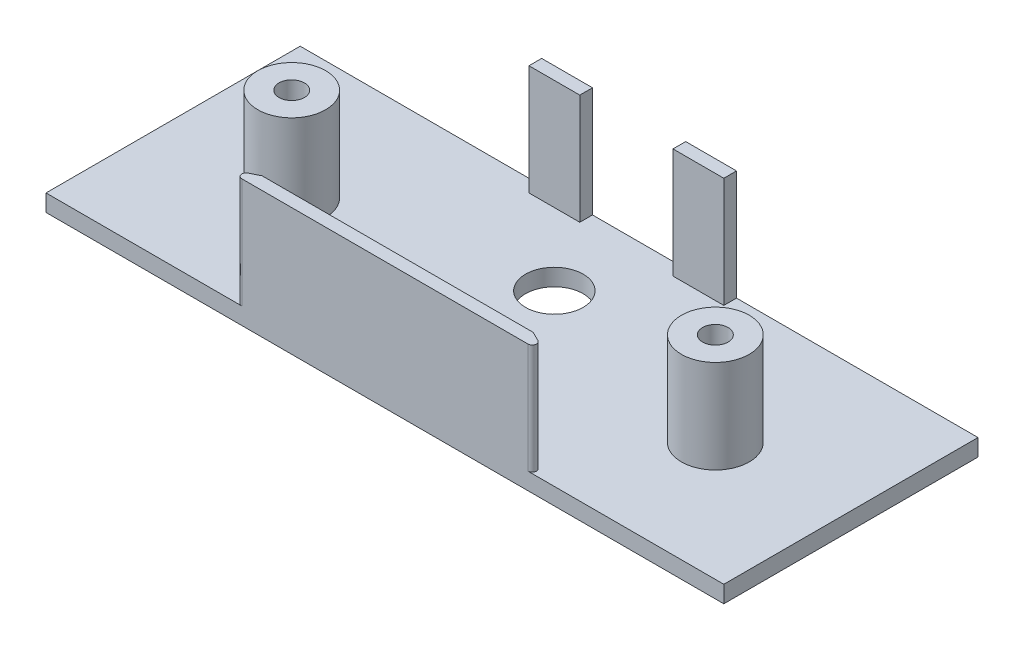
ISO-10303-21;
HEADER;
FILE_DESCRIPTION(('STEP AP214'),'2;1');
FILE_NAME('part.step','',(''),(''),'','','');
FILE_SCHEMA(('AUTOMOTIVE_DESIGN { 1 0 10303 214 1 1 1 1 }'));
ENDSEC;
DATA;
#1=APPLICATION_CONTEXT('core data for automotive mechanical design processes');
#2=APPLICATION_PROTOCOL_DEFINITION('international standard','automotive_design',2000,#1);
#3=PRODUCT_CONTEXT('',#1,'mechanical');
#4=PRODUCT('Part','Part','',(#3));
#5=PRODUCT_RELATED_PRODUCT_CATEGORY('part','',(#4));
#6=PRODUCT_DEFINITION_FORMATION('','',#4);
#7=PRODUCT_DEFINITION_CONTEXT('part definition',#1,'design');
#8=PRODUCT_DEFINITION('design','',#6,#7);
#9=PRODUCT_DEFINITION_SHAPE('','',#8);
#10=(LENGTH_UNIT() NAMED_UNIT(*) SI_UNIT(.MILLI.,.METRE.));
#11=(NAMED_UNIT(*) PLANE_ANGLE_UNIT() SI_UNIT($,.RADIAN.));
#12=(NAMED_UNIT(*) SI_UNIT($,.STERADIAN.) SOLID_ANGLE_UNIT());
#13=UNCERTAINTY_MEASURE_WITH_UNIT(LENGTH_MEASURE(1.E-05),#10,'distance_accuracy_value','');
#14=(GEOMETRIC_REPRESENTATION_CONTEXT(3) GLOBAL_UNCERTAINTY_ASSIGNED_CONTEXT((#13)) GLOBAL_UNIT_ASSIGNED_CONTEXT((#10,
#11,#12)) REPRESENTATION_CONTEXT('',''));
#15=CARTESIAN_POINT('',(0.,0.,0.));
#16=DIRECTION('',(0.,0.,1.));
#17=DIRECTION('',(1.,0.,0.));
#18=AXIS2_PLACEMENT_3D('',#15,#16,#17);
#19=CARTESIAN_POINT('',(0.,2.,0.));
#20=DIRECTION('',(0.,-1.,0.));
#21=DIRECTION('',(0.,0.,-1.));
#22=AXIS2_PLACEMENT_3D('',#19,#20,#21);
#23=PLANE('',#22);
#24=CARTESIAN_POINT('',(50.,2.,0.));
#25=DIRECTION('',(0.,-1.,0.));
#26=DIRECTION('',(0.,0.,-1.));
#27=AXIS2_PLACEMENT_3D('',#24,#25,#26);
#28=CIRCLE('',#27,4.00000000000001);
#29=CARTESIAN_POINT('',(50.,2.,-4.00000000000001));
#30=VERTEX_POINT('',#29);
#31=EDGE_CURVE('E287',#30,#30,#28,.F.);
#32=ORIENTED_EDGE('',*,*,#31,.F.);
#33=EDGE_LOOP('',(#32));
#34=FACE_BOUND('',#33,.T.);
#35=CARTESIAN_POINT('',(25.,2.,-6.));
#36=DIRECTION('',(0.,1.,0.));
#37=DIRECTION('',(0.,0.,1.));
#38=AXIS2_PLACEMENT_3D('',#35,#36,#37);
#39=CIRCLE('',#38,3.4);
#40=CARTESIAN_POINT('',(25.,2.,-2.6));
#41=VERTEX_POINT('',#40);
#42=EDGE_CURVE('E243',#41,#41,#39,.T.);
#43=ORIENTED_EDGE('',*,*,#42,.F.);
#44=EDGE_LOOP('',(#43));
#45=FACE_BOUND('',#44,.T.);
#46=DIRECTION('',(-0.894427190999916,0.,0.447213595499958));
#47=VECTOR('',#46,1.);
#48=CARTESIAN_POINT('',(6.,2.,14.));
#49=LINE('',#48,#47);
#50=CARTESIAN_POINT('',(12.9999999999999,2.,10.5));
#51=VERTEX_POINT('',#50);
#52=CARTESIAN_POINT('',(7.89442719099992,2.,13.0527864045));
#53=VERTEX_POINT('',#52);
#54=EDGE_CURVE('E47',#51,#53,#49,.T.);
#55=ORIENTED_EDGE('',*,*,#54,.F.);
#56=DIRECTION('',(1.,0.,0.));
#57=VECTOR('',#56,1.);
#58=CARTESIAN_POINT('',(41.,2.,10.5));
#59=LINE('',#58,#57);
#60=CARTESIAN_POINT('',(37.0000000000001,2.,10.5));
#61=VERTEX_POINT('',#60);
#62=EDGE_CURVE('E314',#51,#61,#59,.T.);
#63=ORIENTED_EDGE('',*,*,#62,.T.);
#64=DIRECTION('',(-0.894427190999916,0.,-0.447213595499958));
#65=VECTOR('',#64,1.);
#66=CARTESIAN_POINT('',(44.,2.,14.));
#67=LINE('',#66,#65);
#68=CARTESIAN_POINT('',(42.1055728090001,2.,13.0527864045));
#69=VERTEX_POINT('',#68);
#70=EDGE_CURVE('E54',#69,#61,#67,.T.);
#71=ORIENTED_EDGE('',*,*,#70,.F.);
#72=CARTESIAN_POINT('',(41.8819660112501,2.,13.5));
#73=DIRECTION('',(0.,-1.,0.));
#74=DIRECTION('',(0.,0.,-1.));
#75=AXIS2_PLACEMENT_3D('',#72,#73,#74);
#76=CIRCLE('',#75,0.5);
#77=CARTESIAN_POINT('',(41.8819660112501,2.,14.));
#78=VERTEX_POINT('',#77);
#79=EDGE_CURVE('E308',#69,#78,#76,.T.);
#80=ORIENTED_EDGE('',*,*,#79,.T.);
#81=DIRECTION('',(1.,0.,0.));
#82=VECTOR('',#81,1.);
#83=CARTESIAN_POINT('',(-15.,2.,14.));
#84=LINE('',#83,#82);
#85=CARTESIAN_POINT('',(65.,2.,14.));
#86=VERTEX_POINT('',#85);
#87=EDGE_CURVE('E258',#78,#86,#84,.T.);
#88=ORIENTED_EDGE('',*,*,#87,.T.);
#89=DIRECTION('',(0.,0.,-1.));
#90=VECTOR('',#89,1.);
#91=CARTESIAN_POINT('',(65.,2.,14.));
#92=LINE('',#91,#90);
#93=CARTESIAN_POINT('',(65.,2.,-16.));
#94=VERTEX_POINT('',#93);
#95=EDGE_CURVE('E262',#86,#94,#92,.T.);
#96=ORIENTED_EDGE('',*,*,#95,.T.);
#97=DIRECTION('',(-1.,0.,0.));
#98=VECTOR('',#97,1.);
#99=CARTESIAN_POINT('',(-15.,2.,-16.));
#100=LINE('',#99,#98);
#101=CARTESIAN_POINT('',(36.5,2.,-16.));
#102=VERTEX_POINT('',#101);
#103=EDGE_CURVE('E265',#94,#102,#100,.T.);
#104=ORIENTED_EDGE('',*,*,#103,.T.);
#105=DIRECTION('',(0.,0.,-1.));
#106=VECTOR('',#105,1.);
#107=CARTESIAN_POINT('',(36.5,2.,-16.));
#108=LINE('',#107,#106);
#109=CARTESIAN_POINT('',(36.5,2.,-14.5));
#110=VERTEX_POINT('',#109);
#111=EDGE_CURVE('E184',#110,#102,#108,.T.);
#112=ORIENTED_EDGE('',*,*,#111,.F.);
#113=DIRECTION('',(1.,0.,0.));
#114=VECTOR('',#113,1.);
#115=CARTESIAN_POINT('',(30.5,2.,-14.5));
#116=LINE('',#115,#114);
#117=CARTESIAN_POINT('',(30.5,2.,-14.5));
#118=VERTEX_POINT('',#117);
#119=EDGE_CURVE('E365',#118,#110,#116,.T.);
#120=ORIENTED_EDGE('',*,*,#119,.F.);
#121=DIRECTION('',(0.,0.,1.));
#122=VECTOR('',#121,1.);
#123=CARTESIAN_POINT('',(30.5,2.,-16.));
#124=LINE('',#123,#122);
#125=CARTESIAN_POINT('',(30.5,2.,-16.));
#126=VERTEX_POINT('',#125);
#127=EDGE_CURVE('E188',#126,#118,#124,.T.);
#128=ORIENTED_EDGE('',*,*,#127,.F.);
#129=CARTESIAN_POINT('',(19.5,2.,-16.));
#130=VERTEX_POINT('',#129);
#131=EDGE_CURVE('E268',#126,#130,#100,.T.);
#132=ORIENTED_EDGE('',*,*,#131,.T.);
#133=DIRECTION('',(0.,0.,-1.));
#134=VECTOR('',#133,1.);
#135=CARTESIAN_POINT('',(19.5,2.,-16.));
#136=LINE('',#135,#134);
#137=CARTESIAN_POINT('',(19.5,2.,-14.5));
#138=VERTEX_POINT('',#137);
#139=EDGE_CURVE('E202',#138,#130,#136,.T.);
#140=ORIENTED_EDGE('',*,*,#139,.F.);
#141=DIRECTION('',(1.,0.,0.));
#142=VECTOR('',#141,1.);
#143=CARTESIAN_POINT('',(13.5,2.,-14.5));
#144=LINE('',#143,#142);
#145=CARTESIAN_POINT('',(13.5,2.,-14.5));
#146=VERTEX_POINT('',#145);
#147=EDGE_CURVE('E192',#146,#138,#144,.T.);
#148=ORIENTED_EDGE('',*,*,#147,.F.);
#149=DIRECTION('',(0.,0.,1.));
#150=VECTOR('',#149,1.);
#151=CARTESIAN_POINT('',(13.5,2.,-16.));
#152=LINE('',#151,#150);
#153=CARTESIAN_POINT('',(13.5,2.,-16.));
#154=VERTEX_POINT('',#153);
#155=EDGE_CURVE('E189',#154,#146,#152,.T.);
#156=ORIENTED_EDGE('',*,*,#155,.F.);
#157=CARTESIAN_POINT('',(-15.,2.,-16.));
#158=VERTEX_POINT('',#157);
#159=EDGE_CURVE('E264',#154,#158,#100,.T.);
#160=ORIENTED_EDGE('',*,*,#159,.T.);
#161=DIRECTION('',(0.,0.,1.));
#162=VECTOR('',#161,1.);
#163=CARTESIAN_POINT('',(-15.,2.,14.));
#164=LINE('',#163,#162);
#165=CARTESIAN_POINT('',(-15.,2.,14.));
#166=VERTEX_POINT('',#165);
#167=EDGE_CURVE('E255',#158,#166,#164,.T.);
#168=ORIENTED_EDGE('',*,*,#167,.T.);
#169=CARTESIAN_POINT('',(8.11803398874989,2.,14.));
#170=VERTEX_POINT('',#169);
#171=EDGE_CURVE('E260',#166,#170,#84,.T.);
#172=ORIENTED_EDGE('',*,*,#171,.T.);
#173=CARTESIAN_POINT('',(8.11803398874989,2.,13.5));
#174=DIRECTION('',(0.,-1.,0.));
#175=DIRECTION('',(0.,0.,-1.));
#176=AXIS2_PLACEMENT_3D('',#173,#174,#175);
#177=CIRCLE('',#176,0.5);
#178=EDGE_CURVE('E306',#170,#53,#177,.T.);
#179=ORIENTED_EDGE('',*,*,#178,.T.);
#180=EDGE_LOOP('',(#55,#63,#71,#80,#88,#96,#104,#112,#120,#128,#132,#140,#148,#156,#160,#168,
#172,#179));
#181=FACE_BOUND('',#180,.T.);
#182=CARTESIAN_POINT('',(0.,2.,0.));
#183=DIRECTION('',(0.,-1.,0.));
#184=DIRECTION('',(0.,0.,-1.));
#185=AXIS2_PLACEMENT_3D('',#182,#183,#184);
#186=CIRCLE('',#185,4.);
#187=CARTESIAN_POINT('',(0.,2.,-4.));
#188=VERTEX_POINT('',#187);
#189=EDGE_CURVE('E290',#188,#188,#186,.F.);
#190=ORIENTED_EDGE('',*,*,#189,.F.);
#191=EDGE_LOOP('',(#190));
#192=FACE_BOUND('',#191,.T.);
#193=ADVANCED_FACE('F32',(#34,#45,#181,#192),#23,.F.);
#194=CARTESIAN_POINT('',(0.,0.,0.));
#195=DIRECTION('',(0.,-1.,0.));
#196=DIRECTION('',(0.,0.,-1.));
#197=AXIS2_PLACEMENT_3D('',#194,#195,#196);
#198=PLANE('',#197);
#199=CARTESIAN_POINT('',(50.,0.,0.));
#200=DIRECTION('',(0.,1.,0.));
#201=DIRECTION('',(0.,0.,1.));
#202=AXIS2_PLACEMENT_3D('',#199,#200,#201);
#203=CIRCLE('',#202,1.5);
#204=CARTESIAN_POINT('',(50.,0.,1.5));
#205=VERTEX_POINT('',#204);
#206=EDGE_CURVE('E246',#205,#205,#203,.T.);
#207=ORIENTED_EDGE('',*,*,#206,.T.);
#208=EDGE_LOOP('',(#207));
#209=FACE_BOUND('',#208,.T.);
#210=DIRECTION('',(0.,0.,1.));
#211=VECTOR('',#210,1.);
#212=CARTESIAN_POINT('',(-15.,0.,14.));
#213=LINE('',#212,#211);
#214=CARTESIAN_POINT('',(-15.,0.,-16.));
#215=VERTEX_POINT('',#214);
#216=CARTESIAN_POINT('',(-15.,0.,14.));
#217=VERTEX_POINT('',#216);
#218=EDGE_CURVE('E254',#215,#217,#213,.T.);
#219=ORIENTED_EDGE('',*,*,#218,.F.);
#220=DIRECTION('',(-1.,0.,0.));
#221=VECTOR('',#220,1.);
#222=CARTESIAN_POINT('',(-15.,0.,-16.));
#223=LINE('',#222,#221);
#224=CARTESIAN_POINT('',(65.,0.,-16.));
#225=VERTEX_POINT('',#224);
#226=EDGE_CURVE('E259',#225,#215,#223,.T.);
#227=ORIENTED_EDGE('',*,*,#226,.F.);
#228=DIRECTION('',(0.,0.,-1.));
#229=VECTOR('',#228,1.);
#230=CARTESIAN_POINT('',(65.,0.,14.));
#231=LINE('',#230,#229);
#232=CARTESIAN_POINT('',(65.,0.,14.));
#233=VERTEX_POINT('',#232);
#234=EDGE_CURVE('E273',#233,#225,#231,.T.);
#235=ORIENTED_EDGE('',*,*,#234,.F.);
#236=DIRECTION('',(1.,0.,0.));
#237=VECTOR('',#236,1.);
#238=CARTESIAN_POINT('',(-15.,0.,14.));
#239=LINE('',#238,#237);
#240=EDGE_CURVE('E271',#217,#233,#239,.T.);
#241=ORIENTED_EDGE('',*,*,#240,.F.);
#242=EDGE_LOOP('',(#219,#227,#235,#241));
#243=FACE_BOUND('',#242,.T.);
#244=CARTESIAN_POINT('',(0.,0.,0.));
#245=DIRECTION('',(0.,1.,0.));
#246=DIRECTION('',(0.,0.,1.));
#247=AXIS2_PLACEMENT_3D('',#244,#245,#246);
#248=CIRCLE('',#247,1.5);
#249=CARTESIAN_POINT('',(0.,0.,1.5));
#250=VERTEX_POINT('',#249);
#251=EDGE_CURVE('E251',#250,#250,#248,.T.);
#252=ORIENTED_EDGE('',*,*,#251,.T.);
#253=EDGE_LOOP('',(#252));
#254=FACE_BOUND('',#253,.T.);
#255=CARTESIAN_POINT('',(25.,0.,-6.));
#256=DIRECTION('',(0.,1.,0.));
#257=DIRECTION('',(0.,0.,1.));
#258=AXIS2_PLACEMENT_3D('',#255,#256,#257);
#259=CIRCLE('',#258,3.4);
#260=CARTESIAN_POINT('',(25.,0.,-2.6));
#261=VERTEX_POINT('',#260);
#262=EDGE_CURVE('E242',#261,#261,#259,.T.);
#263=ORIENTED_EDGE('',*,*,#262,.T.);
#264=EDGE_LOOP('',(#263));
#265=FACE_BOUND('',#264,.T.);
#266=ADVANCED_FACE('F351',(#209,#243,#254,#265),#198,.T.);
#267=CARTESIAN_POINT('',(-15.,2.,14.));
#268=DIRECTION('',(1.,0.,0.));
#269=DIRECTION('',(0.,0.,-1.));
#270=AXIS2_PLACEMENT_3D('',#267,#268,#269);
#271=PLANE('',#270);
#272=ORIENTED_EDGE('',*,*,#218,.T.);
#273=DIRECTION('',(0.,-1.,0.));
#274=VECTOR('',#273,1.);
#275=CARTESIAN_POINT('',(-15.,2.,14.));
#276=LINE('',#275,#274);
#277=EDGE_CURVE('E284',#166,#217,#276,.T.);
#278=ORIENTED_EDGE('',*,*,#277,.F.);
#279=ORIENTED_EDGE('',*,*,#167,.F.);
#280=DIRECTION('',(0.,-1.,0.));
#281=VECTOR('',#280,1.);
#282=CARTESIAN_POINT('',(-15.,2.,-16.));
#283=LINE('',#282,#281);
#284=EDGE_CURVE('E267',#158,#215,#283,.T.);
#285=ORIENTED_EDGE('',*,*,#284,.T.);
#286=EDGE_LOOP('',(#272,#278,#279,#285));
#287=FACE_BOUND('',#286,.T.);
#288=ADVANCED_FACE('F347',(#287),#271,.F.);
#289=CARTESIAN_POINT('',(-15.,2.,14.));
#290=DIRECTION('',(0.,0.,-1.));
#291=DIRECTION('',(-1.,0.,0.));
#292=AXIS2_PLACEMENT_3D('',#289,#290,#291);
#293=PLANE('',#292);
#294=DIRECTION('',(1.,0.,0.));
#295=VECTOR('',#294,1.);
#296=CARTESIAN_POINT('',(6.,15.,14.));
#297=LINE('',#296,#295);
#298=CARTESIAN_POINT('',(8.11803398874989,15.,14.));
#299=VERTEX_POINT('',#298);
#300=CARTESIAN_POINT('',(41.8819660112501,15.,14.));
#301=VERTEX_POINT('',#300);
#302=EDGE_CURVE('E227',#299,#301,#297,.T.);
#303=ORIENTED_EDGE('',*,*,#302,.F.);
#304=DIRECTION('',(0.,-1.,0.));
#305=VECTOR('',#304,1.);
#306=CARTESIAN_POINT('',(8.11803398874989,2.,14.));
#307=LINE('',#306,#305);
#308=EDGE_CURVE('E295',#299,#170,#307,.T.);
#309=ORIENTED_EDGE('',*,*,#308,.T.);
#310=ORIENTED_EDGE('',*,*,#171,.F.);
#311=ORIENTED_EDGE('',*,*,#277,.T.);
#312=ORIENTED_EDGE('',*,*,#240,.T.);
#313=DIRECTION('',(0.,-1.,0.));
#314=VECTOR('',#313,1.);
#315=CARTESIAN_POINT('',(65.,2.,14.));
#316=LINE('',#315,#314);
#317=EDGE_CURVE('E281',#86,#233,#316,.T.);
#318=ORIENTED_EDGE('',*,*,#317,.F.);
#319=ORIENTED_EDGE('',*,*,#87,.F.);
#320=DIRECTION('',(0.,-1.,0.));
#321=VECTOR('',#320,1.);
#322=CARTESIAN_POINT('',(41.8819660112501,2.,14.));
#323=LINE('',#322,#321);
#324=EDGE_CURVE('E293',#78,#301,#323,.F.);
#325=ORIENTED_EDGE('',*,*,#324,.T.);
#326=EDGE_LOOP('',(#303,#309,#310,#311,#312,#318,#319,#325));
#327=FACE_BOUND('',#326,.T.);
#328=ADVANCED_FACE('F333',(#327),#293,.F.);
#329=CARTESIAN_POINT('',(65.,2.,14.));
#330=DIRECTION('',(-1.,0.,0.));
#331=DIRECTION('',(0.,0.,1.));
#332=AXIS2_PLACEMENT_3D('',#329,#330,#331);
#333=PLANE('',#332);
#334=ORIENTED_EDGE('',*,*,#234,.T.);
#335=DIRECTION('',(0.,-1.,0.));
#336=VECTOR('',#335,1.);
#337=CARTESIAN_POINT('',(65.,2.,-16.));
#338=LINE('',#337,#336);
#339=EDGE_CURVE('E278',#94,#225,#338,.T.);
#340=ORIENTED_EDGE('',*,*,#339,.F.);
#341=ORIENTED_EDGE('',*,*,#95,.F.);
#342=ORIENTED_EDGE('',*,*,#317,.T.);
#343=EDGE_LOOP('',(#334,#340,#341,#342));
#344=FACE_BOUND('',#343,.T.);
#345=ADVANCED_FACE('F356',(#344),#333,.F.);
#346=CARTESIAN_POINT('',(-15.,2.,-16.));
#347=DIRECTION('',(0.,0.,1.));
#348=DIRECTION('',(1.,0.,0.));
#349=AXIS2_PLACEMENT_3D('',#346,#347,#348);
#350=PLANE('',#349);
#351=ORIENTED_EDGE('',*,*,#226,.T.);
#352=ORIENTED_EDGE('',*,*,#284,.F.);
#353=ORIENTED_EDGE('',*,*,#159,.F.);
#354=DIRECTION('',(0.,-1.,0.));
#355=VECTOR('',#354,1.);
#356=CARTESIAN_POINT('',(13.5,15.,-16.));
#357=LINE('',#356,#355);
#358=CARTESIAN_POINT('',(13.5,15.,-16.));
#359=VERTEX_POINT('',#358);
#360=EDGE_CURVE('E207',#359,#154,#357,.T.);
#361=ORIENTED_EDGE('',*,*,#360,.F.);
#362=DIRECTION('',(-1.,0.,0.));
#363=VECTOR('',#362,1.);
#364=CARTESIAN_POINT('',(13.5,15.,-16.));
#365=LINE('',#364,#363);
#366=CARTESIAN_POINT('',(19.5,15.,-16.));
#367=VERTEX_POINT('',#366);
#368=EDGE_CURVE('E206',#367,#359,#365,.T.);
#369=ORIENTED_EDGE('',*,*,#368,.F.);
#370=DIRECTION('',(0.,-1.,0.));
#371=VECTOR('',#370,1.);
#372=CARTESIAN_POINT('',(19.5,15.,-16.));
#373=LINE('',#372,#371);
#374=EDGE_CURVE('E215',#367,#130,#373,.T.);
#375=ORIENTED_EDGE('',*,*,#374,.T.);
#376=ORIENTED_EDGE('',*,*,#131,.F.);
#377=DIRECTION('',(0.,-1.,0.));
#378=VECTOR('',#377,1.);
#379=CARTESIAN_POINT('',(30.5,15.,-16.));
#380=LINE('',#379,#378);
#381=CARTESIAN_POINT('',(30.5,15.,-16.));
#382=VERTEX_POINT('',#381);
#383=EDGE_CURVE('E368',#382,#126,#380,.T.);
#384=ORIENTED_EDGE('',*,*,#383,.F.);
#385=DIRECTION('',(-1.,0.,0.));
#386=VECTOR('',#385,1.);
#387=CARTESIAN_POINT('',(30.5,15.,-16.));
#388=LINE('',#387,#386);
#389=CARTESIAN_POINT('',(36.5,15.,-16.));
#390=VERTEX_POINT('',#389);
#391=EDGE_CURVE('E180',#390,#382,#388,.T.);
#392=ORIENTED_EDGE('',*,*,#391,.F.);
#393=DIRECTION('',(0.,-1.,0.));
#394=VECTOR('',#393,1.);
#395=CARTESIAN_POINT('',(36.5,15.,-16.));
#396=LINE('',#395,#394);
#397=EDGE_CURVE('E194',#390,#102,#396,.T.);
#398=ORIENTED_EDGE('',*,*,#397,.T.);
#399=ORIENTED_EDGE('',*,*,#103,.F.);
#400=ORIENTED_EDGE('',*,*,#339,.T.);
#401=EDGE_LOOP('',(#351,#352,#353,#361,#369,#375,#376,#384,#392,#398,#399,#400));
#402=FACE_BOUND('',#401,.T.);
#403=ADVANCED_FACE('F367',(#402),#350,.F.);
#404=CARTESIAN_POINT('',(0.,2.,0.));
#405=DIRECTION('',(0.,-1.,0.));
#406=DIRECTION('',(0.,0.,-1.));
#407=AXIS2_PLACEMENT_3D('',#404,#405,#406);
#408=CYLINDRICAL_SURFACE('',#407,1.5);
#409=ORIENTED_EDGE('',*,*,#251,.F.);
#410=EDGE_LOOP('',(#409));
#411=FACE_BOUND('',#410,.T.);
#412=CARTESIAN_POINT('',(0.,13.,0.));
#413=DIRECTION('',(0.,1.,0.));
#414=DIRECTION('',(0.,0.,1.));
#415=AXIS2_PLACEMENT_3D('',#412,#413,#414);
#416=CIRCLE('',#415,1.5);
#417=CARTESIAN_POINT('',(0.,13.,1.5));
#418=VERTEX_POINT('',#417);
#419=EDGE_CURVE('E384',#418,#418,#416,.T.);
#420=ORIENTED_EDGE('',*,*,#419,.T.);
#421=EDGE_LOOP('',(#420));
#422=FACE_BOUND('',#421,.T.);
#423=ADVANCED_FACE('F388',(#411,#422),#408,.F.);
#424=CARTESIAN_POINT('',(50.,2.,0.));
#425=DIRECTION('',(0.,-1.,0.));
#426=DIRECTION('',(0.,0.,-1.));
#427=AXIS2_PLACEMENT_3D('',#424,#425,#426);
#428=CYLINDRICAL_SURFACE('',#427,1.5);
#429=ORIENTED_EDGE('',*,*,#206,.F.);
#430=EDGE_LOOP('',(#429));
#431=FACE_BOUND('',#430,.T.);
#432=CARTESIAN_POINT('',(50.,13.,0.));
#433=DIRECTION('',(0.,1.,0.));
#434=DIRECTION('',(0.,0.,1.));
#435=AXIS2_PLACEMENT_3D('',#432,#433,#434);
#436=CIRCLE('',#435,1.5);
#437=CARTESIAN_POINT('',(50.,13.,1.5));
#438=VERTEX_POINT('',#437);
#439=EDGE_CURVE('E378',#438,#438,#436,.T.);
#440=ORIENTED_EDGE('',*,*,#439,.T.);
#441=EDGE_LOOP('',(#440));
#442=FACE_BOUND('',#441,.T.);
#443=ADVANCED_FACE('F531',(#431,#442),#428,.F.);
#444=CARTESIAN_POINT('',(25.,2.,-6.));
#445=DIRECTION('',(0.,-1.,0.));
#446=DIRECTION('',(0.,0.,-1.));
#447=AXIS2_PLACEMENT_3D('',#444,#445,#446);
#448=CYLINDRICAL_SURFACE('',#447,3.4);
#449=ORIENTED_EDGE('',*,*,#42,.T.);
#450=EDGE_LOOP('',(#449));
#451=FACE_BOUND('',#450,.T.);
#452=ORIENTED_EDGE('',*,*,#262,.F.);
#453=EDGE_LOOP('',(#452));
#454=FACE_BOUND('',#453,.T.);
#455=ADVANCED_FACE('F463',(#451,#454),#448,.F.);
#456=CARTESIAN_POINT('',(6.,15.,14.));
#457=DIRECTION('',(0.447213595499958,0.,0.894427190999916));
#458=DIRECTION('',(0.894427190999916,0.,-0.447213595499958));
#459=AXIS2_PLACEMENT_3D('',#456,#457,#458);
#460=PLANE('',#459);
#461=ORIENTED_EDGE('',*,*,#54,.T.);
#462=DIRECTION('',(0.,-1.,0.));
#463=VECTOR('',#462,1.);
#464=CARTESIAN_POINT('',(7.89442719099992,15.,13.0527864045));
#465=LINE('',#464,#463);
#466=CARTESIAN_POINT('',(7.89442719099992,15.,13.0527864045));
#467=VERTEX_POINT('',#466);
#468=EDGE_CURVE('E298',#53,#467,#465,.F.);
#469=ORIENTED_EDGE('',*,*,#468,.T.);
#470=DIRECTION('',(-0.894427190999916,0.,0.447213595499958));
#471=VECTOR('',#470,1.);
#472=CARTESIAN_POINT('',(6.,15.,14.));
#473=LINE('',#472,#471);
#474=CARTESIAN_POINT('',(9.,15.,12.5));
#475=VERTEX_POINT('',#474);
#476=EDGE_CURVE('E224',#475,#467,#473,.T.);
#477=ORIENTED_EDGE('',*,*,#476,.F.);
#478=DIRECTION('',(0.,-1.,0.));
#479=VECTOR('',#478,1.);
#480=CARTESIAN_POINT('',(9.,15.,12.5));
#481=LINE('',#480,#479);
#482=CARTESIAN_POINT('',(9.,4.00000000000001,12.5));
#483=VERTEX_POINT('',#482);
#484=EDGE_CURVE('E234',#475,#483,#481,.T.);
#485=ORIENTED_EDGE('',*,*,#484,.T.);
#486=DIRECTION('',(-0.816496580927723,0.40824829046387,0.408248290463862));
#487=VECTOR('',#486,1.);
#488=CARTESIAN_POINT('',(2.83333333333331,7.08333333333342,15.5833333333334));
#489=LINE('',#488,#487);
#490=EDGE_CURVE('E40',#483,#51,#489,.F.);
#491=ORIENTED_EDGE('',*,*,#490,.T.);
#492=EDGE_LOOP('',(#461,#469,#477,#485,#491));
#493=FACE_BOUND('',#492,.T.);
#494=ADVANCED_FACE('F317',(#493),#460,.F.);
#495=CARTESIAN_POINT('',(44.,15.,14.));
#496=DIRECTION('',(-0.447213595499958,0.,0.894427190999916));
#497=DIRECTION('',(0.894427190999916,0.,0.447213595499958));
#498=AXIS2_PLACEMENT_3D('',#495,#496,#497);
#499=PLANE('',#498);
#500=DIRECTION('',(-0.894427190999916,0.,-0.447213595499958));
#501=VECTOR('',#500,1.);
#502=CARTESIAN_POINT('',(44.,15.,14.));
#503=LINE('',#502,#501);
#504=CARTESIAN_POINT('',(42.1055728090001,15.,13.0527864045));
#505=VERTEX_POINT('',#504);
#506=CARTESIAN_POINT('',(41.,15.,12.5));
#507=VERTEX_POINT('',#506);
#508=EDGE_CURVE('E230',#505,#507,#503,.T.);
#509=ORIENTED_EDGE('',*,*,#508,.F.);
#510=DIRECTION('',(0.,-1.,0.));
#511=VECTOR('',#510,1.);
#512=CARTESIAN_POINT('',(42.1055728090001,15.,13.0527864045));
#513=LINE('',#512,#511);
#514=EDGE_CURVE('E304',#505,#69,#513,.T.);
#515=ORIENTED_EDGE('',*,*,#514,.T.);
#516=ORIENTED_EDGE('',*,*,#70,.T.);
#517=DIRECTION('',(-0.816496580927723,-0.40824829046387,-0.408248290463862));
#518=VECTOR('',#517,1.);
#519=CARTESIAN_POINT('',(47.1666666666667,7.08333333333342,15.5833333333333));
#520=LINE('',#519,#518);
#521=CARTESIAN_POINT('',(41.,4.00000000000001,12.5));
#522=VERTEX_POINT('',#521);
#523=EDGE_CURVE('E11',#61,#522,#520,.F.);
#524=ORIENTED_EDGE('',*,*,#523,.T.);
#525=DIRECTION('',(0.,-1.,0.));
#526=VECTOR('',#525,1.);
#527=CARTESIAN_POINT('',(41.,15.,12.5));
#528=LINE('',#527,#526);
#529=EDGE_CURVE('E239',#507,#522,#528,.T.);
#530=ORIENTED_EDGE('',*,*,#529,.F.);
#531=EDGE_LOOP('',(#509,#515,#516,#524,#530));
#532=FACE_BOUND('',#531,.T.);
#533=ADVANCED_FACE('F444',(#532),#499,.F.);
#534=CARTESIAN_POINT('',(9.,15.,12.5));
#535=DIRECTION('',(0.,0.,1.));
#536=DIRECTION('',(1.,0.,0.));
#537=AXIS2_PLACEMENT_3D('',#534,#535,#536);
#538=PLANE('',#537);
#539=ORIENTED_EDGE('',*,*,#529,.T.);
#540=DIRECTION('',(-1.,0.,0.));
#541=VECTOR('',#540,1.);
#542=CARTESIAN_POINT('',(9.,4.00000000000001,12.5));
#543=LINE('',#542,#541);
#544=EDGE_CURVE('E311',#522,#483,#543,.T.);
#545=ORIENTED_EDGE('',*,*,#544,.T.);
#546=ORIENTED_EDGE('',*,*,#484,.F.);
#547=DIRECTION('',(-1.,0.,0.));
#548=VECTOR('',#547,1.);
#549=CARTESIAN_POINT('',(9.,15.,12.5));
#550=LINE('',#549,#548);
#551=EDGE_CURVE('E232',#507,#475,#550,.T.);
#552=ORIENTED_EDGE('',*,*,#551,.F.);
#553=EDGE_LOOP('',(#539,#545,#546,#552));
#554=FACE_BOUND('',#553,.T.);
#555=ADVANCED_FACE('F439',(#554),#538,.F.);
#556=CARTESIAN_POINT('',(0.,15.,0.));
#557=DIRECTION('',(0.,1.,0.));
#558=DIRECTION('',(0.,0.,1.));
#559=AXIS2_PLACEMENT_3D('',#556,#557,#558);
#560=PLANE('',#559);
#561=ORIENTED_EDGE('',*,*,#476,.T.);
#562=CARTESIAN_POINT('',(8.11803398874989,15.,13.5));
#563=DIRECTION('',(0.,1.,0.));
#564=DIRECTION('',(0.,0.,1.));
#565=AXIS2_PLACEMENT_3D('',#562,#563,#564);
#566=CIRCLE('',#565,0.5);
#567=EDGE_CURVE('E302',#467,#299,#566,.T.);
#568=ORIENTED_EDGE('',*,*,#567,.T.);
#569=ORIENTED_EDGE('',*,*,#302,.T.);
#570=CARTESIAN_POINT('',(41.8819660112501,15.,13.5));
#571=DIRECTION('',(0.,1.,0.));
#572=DIRECTION('',(0.,0.,1.));
#573=AXIS2_PLACEMENT_3D('',#570,#571,#572);
#574=CIRCLE('',#573,0.5);
#575=EDGE_CURVE('E300',#301,#505,#574,.T.);
#576=ORIENTED_EDGE('',*,*,#575,.T.);
#577=ORIENTED_EDGE('',*,*,#508,.T.);
#578=ORIENTED_EDGE('',*,*,#551,.T.);
#579=EDGE_LOOP('',(#561,#568,#569,#576,#577,#578));
#580=FACE_BOUND('',#579,.T.);
#581=ADVANCED_FACE('F336',(#580),#560,.T.);
#582=CARTESIAN_POINT('',(13.5,15.,-16.));
#583=DIRECTION('',(1.,0.,0.));
#584=DIRECTION('',(0.,0.,-1.));
#585=AXIS2_PLACEMENT_3D('',#582,#583,#584);
#586=PLANE('',#585);
#587=ORIENTED_EDGE('',*,*,#155,.T.);
#588=DIRECTION('',(0.,-1.,0.));
#589=VECTOR('',#588,1.);
#590=CARTESIAN_POINT('',(13.5,15.,-14.5));
#591=LINE('',#590,#589);
#592=CARTESIAN_POINT('',(13.5,15.,-14.5));
#593=VERTEX_POINT('',#592);
#594=EDGE_CURVE('E221',#593,#146,#591,.T.);
#595=ORIENTED_EDGE('',*,*,#594,.F.);
#596=DIRECTION('',(0.,0.,1.));
#597=VECTOR('',#596,1.);
#598=CARTESIAN_POINT('',(13.5,15.,-16.));
#599=LINE('',#598,#597);
#600=EDGE_CURVE('E198',#359,#593,#599,.T.);
#601=ORIENTED_EDGE('',*,*,#600,.F.);
#602=ORIENTED_EDGE('',*,*,#360,.T.);
#603=EDGE_LOOP('',(#587,#595,#601,#602));
#604=FACE_BOUND('',#603,.T.);
#605=ADVANCED_FACE('F489',(#604),#586,.F.);
#606=CARTESIAN_POINT('',(13.5,15.,-14.5));
#607=DIRECTION('',(0.,0.,-1.));
#608=DIRECTION('',(-1.,0.,0.));
#609=AXIS2_PLACEMENT_3D('',#606,#607,#608);
#610=PLANE('',#609);
#611=ORIENTED_EDGE('',*,*,#147,.T.);
#612=DIRECTION('',(0.,-1.,0.));
#613=VECTOR('',#612,1.);
#614=CARTESIAN_POINT('',(19.5,15.,-14.5));
#615=LINE('',#614,#613);
#616=CARTESIAN_POINT('',(19.5,15.,-14.5));
#617=VERTEX_POINT('',#616);
#618=EDGE_CURVE('E218',#617,#138,#615,.T.);
#619=ORIENTED_EDGE('',*,*,#618,.F.);
#620=DIRECTION('',(1.,0.,0.));
#621=VECTOR('',#620,1.);
#622=CARTESIAN_POINT('',(13.5,15.,-14.5));
#623=LINE('',#622,#621);
#624=EDGE_CURVE('E201',#593,#617,#623,.T.);
#625=ORIENTED_EDGE('',*,*,#624,.F.);
#626=ORIENTED_EDGE('',*,*,#594,.T.);
#627=EDGE_LOOP('',(#611,#619,#625,#626));
#628=FACE_BOUND('',#627,.T.);
#629=ADVANCED_FACE('F593',(#628),#610,.F.);
#630=CARTESIAN_POINT('',(19.5,15.,-16.));
#631=DIRECTION('',(-1.,0.,0.));
#632=DIRECTION('',(0.,0.,1.));
#633=AXIS2_PLACEMENT_3D('',#630,#631,#632);
#634=PLANE('',#633);
#635=ORIENTED_EDGE('',*,*,#139,.T.);
#636=ORIENTED_EDGE('',*,*,#374,.F.);
#637=DIRECTION('',(0.,0.,-1.));
#638=VECTOR('',#637,1.);
#639=CARTESIAN_POINT('',(19.5,15.,-16.));
#640=LINE('',#639,#638);
#641=EDGE_CURVE('E204',#617,#367,#640,.T.);
#642=ORIENTED_EDGE('',*,*,#641,.F.);
#643=ORIENTED_EDGE('',*,*,#618,.T.);
#644=EDGE_LOOP('',(#635,#636,#642,#643));
#645=FACE_BOUND('',#644,.T.);
#646=ADVANCED_FACE('F583',(#645),#634,.F.);
#647=CARTESIAN_POINT('',(0.,15.,0.));
#648=DIRECTION('',(0.,1.,0.));
#649=DIRECTION('',(0.,0.,1.));
#650=AXIS2_PLACEMENT_3D('',#647,#648,#649);
#651=PLANE('',#650);
#652=ORIENTED_EDGE('',*,*,#600,.T.);
#653=ORIENTED_EDGE('',*,*,#624,.T.);
#654=ORIENTED_EDGE('',*,*,#641,.T.);
#655=ORIENTED_EDGE('',*,*,#368,.T.);
#656=EDGE_LOOP('',(#652,#653,#654,#655));
#657=FACE_BOUND('',#656,.T.);
#658=ADVANCED_FACE('F574',(#657),#651,.T.);
#659=CARTESIAN_POINT('',(30.5,15.,-16.));
#660=DIRECTION('',(1.,0.,0.));
#661=DIRECTION('',(0.,0.,-1.));
#662=AXIS2_PLACEMENT_3D('',#659,#660,#661);
#663=PLANE('',#662);
#664=ORIENTED_EDGE('',*,*,#127,.T.);
#665=DIRECTION('',(0.,-1.,0.));
#666=VECTOR('',#665,1.);
#667=CARTESIAN_POINT('',(30.5,15.,-14.5));
#668=LINE('',#667,#666);
#669=CARTESIAN_POINT('',(30.5,15.,-14.5));
#670=VERTEX_POINT('',#669);
#671=EDGE_CURVE('E168',#670,#118,#668,.T.);
#672=ORIENTED_EDGE('',*,*,#671,.F.);
#673=DIRECTION('',(0.,0.,1.));
#674=VECTOR('',#673,1.);
#675=CARTESIAN_POINT('',(30.5,15.,-16.));
#676=LINE('',#675,#674);
#677=EDGE_CURVE('E175',#382,#670,#676,.T.);
#678=ORIENTED_EDGE('',*,*,#677,.F.);
#679=ORIENTED_EDGE('',*,*,#383,.T.);
#680=EDGE_LOOP('',(#664,#672,#678,#679));
#681=FACE_BOUND('',#680,.T.);
#682=ADVANCED_FACE('F186',(#681),#663,.F.);
#683=CARTESIAN_POINT('',(30.5,15.,-14.5));
#684=DIRECTION('',(0.,0.,-1.));
#685=DIRECTION('',(-1.,0.,0.));
#686=AXIS2_PLACEMENT_3D('',#683,#684,#685);
#687=PLANE('',#686);
#688=ORIENTED_EDGE('',*,*,#119,.T.);
#689=DIRECTION('',(0.,-1.,0.));
#690=VECTOR('',#689,1.);
#691=CARTESIAN_POINT('',(36.5,15.,-14.5));
#692=LINE('',#691,#690);
#693=CARTESIAN_POINT('',(36.5,15.,-14.5));
#694=VERTEX_POINT('',#693);
#695=EDGE_CURVE('E171',#694,#110,#692,.T.);
#696=ORIENTED_EDGE('',*,*,#695,.F.);
#697=DIRECTION('',(1.,0.,0.));
#698=VECTOR('',#697,1.);
#699=CARTESIAN_POINT('',(30.5,15.,-14.5));
#700=LINE('',#699,#698);
#701=EDGE_CURVE('E163',#670,#694,#700,.T.);
#702=ORIENTED_EDGE('',*,*,#701,.F.);
#703=ORIENTED_EDGE('',*,*,#671,.T.);
#704=EDGE_LOOP('',(#688,#696,#702,#703));
#705=FACE_BOUND('',#704,.T.);
#706=ADVANCED_FACE('F166',(#705),#687,.F.);
#707=CARTESIAN_POINT('',(36.5,15.,-16.));
#708=DIRECTION('',(-1.,0.,0.));
#709=DIRECTION('',(0.,0.,1.));
#710=AXIS2_PLACEMENT_3D('',#707,#708,#709);
#711=PLANE('',#710);
#712=ORIENTED_EDGE('',*,*,#111,.T.);
#713=ORIENTED_EDGE('',*,*,#397,.F.);
#714=DIRECTION('',(0.,0.,-1.));
#715=VECTOR('',#714,1.);
#716=CARTESIAN_POINT('',(36.5,15.,-16.));
#717=LINE('',#716,#715);
#718=EDGE_CURVE('E174',#694,#390,#717,.T.);
#719=ORIENTED_EDGE('',*,*,#718,.F.);
#720=ORIENTED_EDGE('',*,*,#695,.T.);
#721=EDGE_LOOP('',(#712,#713,#719,#720));
#722=FACE_BOUND('',#721,.T.);
#723=ADVANCED_FACE('F364',(#722),#711,.F.);
#724=CARTESIAN_POINT('',(0.,15.,0.));
#725=DIRECTION('',(0.,1.,0.));
#726=DIRECTION('',(0.,0.,1.));
#727=AXIS2_PLACEMENT_3D('',#724,#725,#726);
#728=PLANE('',#727);
#729=ORIENTED_EDGE('',*,*,#677,.T.);
#730=ORIENTED_EDGE('',*,*,#701,.T.);
#731=ORIENTED_EDGE('',*,*,#718,.T.);
#732=ORIENTED_EDGE('',*,*,#391,.T.);
#733=EDGE_LOOP('',(#729,#730,#731,#732));
#734=FACE_BOUND('',#733,.T.);
#735=ADVANCED_FACE('F178',(#734),#728,.T.);
#736=CARTESIAN_POINT('',(50.,13.,0.));
#737=DIRECTION('',(0.,1.,0.));
#738=DIRECTION('',(0.,0.,1.));
#739=AXIS2_PLACEMENT_3D('',#736,#737,#738);
#740=PLANE('',#739);
#741=CARTESIAN_POINT('',(50.,13.,0.));
#742=DIRECTION('',(0.,1.,0.));
#743=DIRECTION('',(0.,0.,1.));
#744=AXIS2_PLACEMENT_3D('',#741,#742,#743);
#745=CIRCLE('',#744,4.00000000000001);
#746=CARTESIAN_POINT('',(50.,13.,4.00000000000001));
#747=VERTEX_POINT('',#746);
#748=EDGE_CURVE('E373',#747,#747,#745,.T.);
#749=ORIENTED_EDGE('',*,*,#748,.T.);
#750=EDGE_LOOP('',(#749));
#751=FACE_BOUND('',#750,.T.);
#752=ORIENTED_EDGE('',*,*,#439,.F.);
#753=EDGE_LOOP('',(#752));
#754=FACE_BOUND('',#753,.T.);
#755=ADVANCED_FACE('F402',(#751,#754),#740,.T.);
#756=CARTESIAN_POINT('',(50.,13.,0.));
#757=DIRECTION('',(0.,-1.,0.));
#758=DIRECTION('',(0.,0.,-1.));
#759=AXIS2_PLACEMENT_3D('',#756,#757,#758);
#760=CYLINDRICAL_SURFACE('',#759,4.00000000000001);
#761=ORIENTED_EDGE('',*,*,#748,.F.);
#762=EDGE_LOOP('',(#761));
#763=FACE_BOUND('',#762,.T.);
#764=ORIENTED_EDGE('',*,*,#31,.T.);
#765=EDGE_LOOP('',(#764));
#766=FACE_BOUND('',#765,.T.);
#767=ADVANCED_FACE('F393',(#763,#766),#760,.T.);
#768=CARTESIAN_POINT('',(0.,13.,0.));
#769=DIRECTION('',(0.,1.,0.));
#770=DIRECTION('',(0.,0.,1.));
#771=AXIS2_PLACEMENT_3D('',#768,#769,#770);
#772=PLANE('',#771);
#773=CARTESIAN_POINT('',(0.,13.,0.));
#774=DIRECTION('',(0.,1.,0.));
#775=DIRECTION('',(0.,0.,1.));
#776=AXIS2_PLACEMENT_3D('',#773,#774,#775);
#777=CIRCLE('',#776,4.);
#778=CARTESIAN_POINT('',(0.,13.,4.));
#779=VERTEX_POINT('',#778);
#780=EDGE_CURVE('E381',#779,#779,#777,.T.);
#781=ORIENTED_EDGE('',*,*,#780,.T.);
#782=EDGE_LOOP('',(#781));
#783=FACE_BOUND('',#782,.T.);
#784=ORIENTED_EDGE('',*,*,#419,.F.);
#785=EDGE_LOOP('',(#784));
#786=FACE_BOUND('',#785,.T.);
#787=ADVANCED_FACE('F390',(#783,#786),#772,.T.);
#788=CARTESIAN_POINT('',(0.,13.,0.));
#789=DIRECTION('',(0.,-1.,0.));
#790=DIRECTION('',(0.,0.,-1.));
#791=AXIS2_PLACEMENT_3D('',#788,#789,#790);
#792=CYLINDRICAL_SURFACE('',#791,4.);
#793=ORIENTED_EDGE('',*,*,#780,.F.);
#794=EDGE_LOOP('',(#793));
#795=FACE_BOUND('',#794,.T.);
#796=ORIENTED_EDGE('',*,*,#189,.T.);
#797=EDGE_LOOP('',(#796));
#798=FACE_BOUND('',#797,.T.);
#799=ADVANCED_FACE('F392',(#795,#798),#792,.T.);
#800=CARTESIAN_POINT('',(8.11803398874989,2.,13.5));
#801=DIRECTION('',(0.,-1.,0.));
#802=DIRECTION('',(0.,0.,-1.));
#803=AXIS2_PLACEMENT_3D('',#800,#801,#802);
#804=CYLINDRICAL_SURFACE('',#803,0.5);
#805=ORIENTED_EDGE('',*,*,#567,.F.);
#806=ORIENTED_EDGE('',*,*,#468,.F.);
#807=ORIENTED_EDGE('',*,*,#178,.F.);
#808=ORIENTED_EDGE('',*,*,#308,.F.);
#809=EDGE_LOOP('',(#805,#806,#807,#808));
#810=FACE_BOUND('',#809,.T.);
#811=ADVANCED_FACE('F340',(#810),#804,.T.);
#812=CARTESIAN_POINT('',(41.8819660112501,15.,13.5));
#813=DIRECTION('',(0.,-1.,0.));
#814=DIRECTION('',(0.,0.,-1.));
#815=AXIS2_PLACEMENT_3D('',#812,#813,#814);
#816=CYLINDRICAL_SURFACE('',#815,0.5);
#817=ORIENTED_EDGE('',*,*,#575,.F.);
#818=ORIENTED_EDGE('',*,*,#324,.F.);
#819=ORIENTED_EDGE('',*,*,#79,.F.);
#820=ORIENTED_EDGE('',*,*,#514,.F.);
#821=EDGE_LOOP('',(#817,#818,#819,#820));
#822=FACE_BOUND('',#821,.T.);
#823=ADVANCED_FACE('F330',(#822),#816,.T.);
#824=CARTESIAN_POINT('',(9.,4.00000000000001,12.5));
#825=DIRECTION('',(0.,0.707106781186541,-0.707106781186554));
#826=DIRECTION('',(1.,0.,0.));
#827=AXIS2_PLACEMENT_3D('',#824,#825,#826);
#828=PLANE('',#827);
#829=ORIENTED_EDGE('',*,*,#523,.F.);
#830=ORIENTED_EDGE('',*,*,#62,.F.);
#831=ORIENTED_EDGE('',*,*,#490,.F.);
#832=ORIENTED_EDGE('',*,*,#544,.F.);
#833=EDGE_LOOP('',(#829,#830,#831,#832));
#834=FACE_BOUND('',#833,.T.);
#835=ADVANCED_FACE('F34',(#834),#828,.T.);
#836=CLOSED_SHELL('',(#193,#266,#288,#328,#345,#403,#423,#443,#455,#494,#533,#555,#581,#605,
#629,#646,#658,#682,#706,#723,#735,#755,#767,#787,#799,#811,#823,#835));
#837=MANIFOLD_SOLID_BREP('B2',#836);
#838=ADVANCED_BREP_SHAPE_REPRESENTATION('',(#18,#837),#14);
#839=SHAPE_DEFINITION_REPRESENTATION(#9,#838);
ENDSEC;
END-ISO-10303-21;
